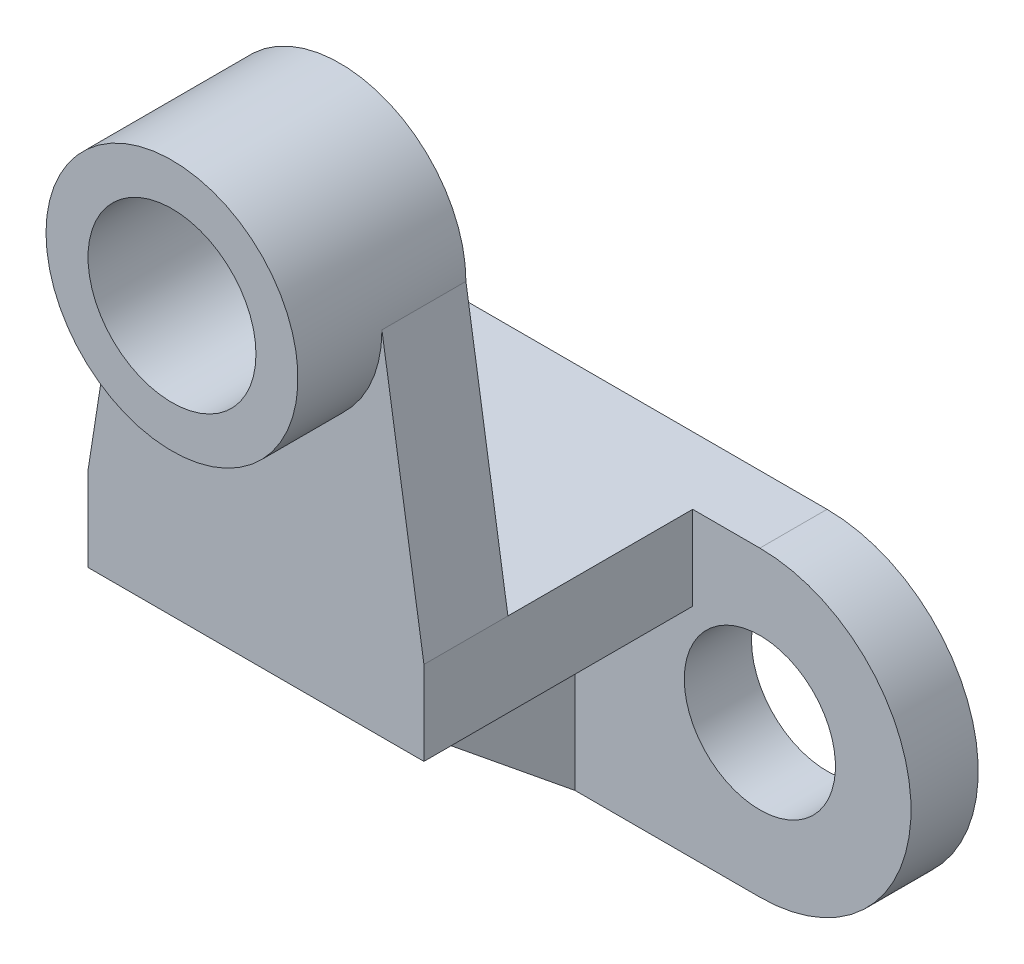
ISO-10303-21;
HEADER;
FILE_DESCRIPTION(('STEP AP214'),'2;1');
FILE_NAME('part.step','',(''),(''),'','','');
FILE_SCHEMA(('AUTOMOTIVE_DESIGN { 1 0 10303 214 1 1 1 1 }'));
ENDSEC;
DATA;
#1=APPLICATION_CONTEXT('core data for automotive mechanical design processes');
#2=APPLICATION_PROTOCOL_DEFINITION('international standard','automotive_design',2000,#1);
#3=PRODUCT_CONTEXT('',#1,'mechanical');
#4=PRODUCT('Part','Part','',(#3));
#5=PRODUCT_RELATED_PRODUCT_CATEGORY('part','',(#4));
#6=PRODUCT_DEFINITION_FORMATION('','',#4);
#7=PRODUCT_DEFINITION_CONTEXT('part definition',#1,'design');
#8=PRODUCT_DEFINITION('design','',#6,#7);
#9=PRODUCT_DEFINITION_SHAPE('','',#8);
#10=(LENGTH_UNIT() NAMED_UNIT(*) SI_UNIT(.MILLI.,.METRE.));
#11=(NAMED_UNIT(*) PLANE_ANGLE_UNIT() SI_UNIT($,.RADIAN.));
#12=(NAMED_UNIT(*) SI_UNIT($,.STERADIAN.) SOLID_ANGLE_UNIT());
#13=UNCERTAINTY_MEASURE_WITH_UNIT(LENGTH_MEASURE(1.E-05),#10,'distance_accuracy_value','');
#14=(GEOMETRIC_REPRESENTATION_CONTEXT(3) GLOBAL_UNCERTAINTY_ASSIGNED_CONTEXT((#13)) GLOBAL_UNIT_ASSIGNED_CONTEXT((#10,
#11,#12)) REPRESENTATION_CONTEXT('',''));
#15=CARTESIAN_POINT('',(0.,0.,0.));
#16=DIRECTION('',(0.,0.,1.));
#17=DIRECTION('',(1.,0.,0.));
#18=AXIS2_PLACEMENT_3D('',#15,#16,#17);
#19=CARTESIAN_POINT('',(56.,36.,8.));
#20=DIRECTION('',(0.,-1.,0.));
#21=DIRECTION('',(0.,0.,-1.));
#22=AXIS2_PLACEMENT_3D('',#19,#20,#21);
#23=PLANE('',#22);
#24=DIRECTION('',(-1.,0.,0.));
#25=VECTOR('',#24,1.);
#26=CARTESIAN_POINT('',(48.,36.,30.));
#27=LINE('',#26,#25);
#28=CARTESIAN_POINT('',(48.,36.,30.));
#29=VERTEX_POINT('',#28);
#30=CARTESIAN_POINT('',(8.,36.,30.));
#31=VERTEX_POINT('',#30);
#32=EDGE_CURVE('E162',#29,#31,#27,.T.);
#33=ORIENTED_EDGE('',*,*,#32,.F.);
#34=DIRECTION('',(0.,0.,-1.));
#35=VECTOR('',#34,1.);
#36=CARTESIAN_POINT('',(48.,36.,40.));
#37=LINE('',#36,#35);
#38=CARTESIAN_POINT('',(48.,36.,8.));
#39=VERTEX_POINT('',#38);
#40=EDGE_CURVE('E174',#29,#39,#37,.T.);
#41=ORIENTED_EDGE('',*,*,#40,.T.);
#42=DIRECTION('',(-1.,0.,0.));
#43=VECTOR('',#42,1.);
#44=CARTESIAN_POINT('',(56.,36.,8.));
#45=LINE('',#44,#43);
#46=CARTESIAN_POINT('',(56.,36.,8.));
#47=VERTEX_POINT('',#46);
#48=EDGE_CURVE('E225',#47,#39,#45,.T.);
#49=ORIENTED_EDGE('',*,*,#48,.F.);
#50=DIRECTION('',(0.,0.,-1.));
#51=VECTOR('',#50,1.);
#52=CARTESIAN_POINT('',(56.,36.,8.));
#53=LINE('',#52,#51);
#54=CARTESIAN_POINT('',(56.,36.,0.));
#55=VERTEX_POINT('',#54);
#56=EDGE_CURVE('E261',#47,#55,#53,.T.);
#57=ORIENTED_EDGE('',*,*,#56,.T.);
#58=DIRECTION('',(-1.,0.,0.));
#59=VECTOR('',#58,1.);
#60=CARTESIAN_POINT('',(56.,36.,0.));
#61=LINE('',#60,#59);
#62=CARTESIAN_POINT('',(0.,36.,0.));
#63=VERTEX_POINT('',#62);
#64=EDGE_CURVE('E242',#55,#63,#61,.T.);
#65=ORIENTED_EDGE('',*,*,#64,.T.);
#66=DIRECTION('',(0.,0.,-1.));
#67=VECTOR('',#66,1.);
#68=CARTESIAN_POINT('',(0.,36.,8.));
#69=LINE('',#68,#67);
#70=CARTESIAN_POINT('',(0.,36.,8.));
#71=VERTEX_POINT('',#70);
#72=EDGE_CURVE('E258',#71,#63,#69,.T.);
#73=ORIENTED_EDGE('',*,*,#72,.F.);
#74=CARTESIAN_POINT('',(8.,36.,8.));
#75=VERTEX_POINT('',#74);
#76=EDGE_CURVE('E172',#75,#71,#45,.T.);
#77=ORIENTED_EDGE('',*,*,#76,.F.);
#78=DIRECTION('',(0.,0.,-1.));
#79=VECTOR('',#78,1.);
#80=CARTESIAN_POINT('',(8.,36.,40.));
#81=LINE('',#80,#79);
#82=EDGE_CURVE('E154',#31,#75,#81,.T.);
#83=ORIENTED_EDGE('',*,*,#82,.F.);
#84=EDGE_LOOP('',(#33,#41,#49,#57,#65,#73,#77,#83));
#85=FACE_BOUND('',#84,.T.);
#86=ADVANCED_FACE('F39',(#85),#23,.F.);
#87=CARTESIAN_POINT('',(56.,18.,8.));
#88=DIRECTION('',(0.,0.,1.));
#89=DIRECTION('',(1.,0.,0.));
#90=AXIS2_PLACEMENT_3D('',#87,#88,#89);
#91=PLANE('',#90);
#92=DIRECTION('',(0.,1.,0.));
#93=VECTOR('',#92,1.);
#94=CARTESIAN_POINT('',(48.,36.,8.));
#95=LINE('',#94,#93);
#96=CARTESIAN_POINT('',(48.,26.,8.));
#97=VERTEX_POINT('',#96);
#98=EDGE_CURVE('E185',#97,#39,#95,.T.);
#99=ORIENTED_EDGE('',*,*,#98,.F.);
#100=DIRECTION('',(1.,0.,0.));
#101=VECTOR('',#100,1.);
#102=CARTESIAN_POINT('',(48.,26.,8.));
#103=LINE('',#102,#101);
#104=CARTESIAN_POINT('',(34.,26.,8.));
#105=VERTEX_POINT('',#104);
#106=EDGE_CURVE('E317',#105,#97,#103,.T.);
#107=ORIENTED_EDGE('',*,*,#106,.F.);
#108=DIRECTION('',(0.,1.,0.));
#109=VECTOR('',#108,1.);
#110=CARTESIAN_POINT('',(34.,26.,8.));
#111=LINE('',#110,#109);
#112=CARTESIAN_POINT('',(34.,0.,8.));
#113=VERTEX_POINT('',#112);
#114=EDGE_CURVE('E314',#113,#105,#111,.T.);
#115=ORIENTED_EDGE('',*,*,#114,.F.);
#116=DIRECTION('',(1.,0.,0.));
#117=VECTOR('',#116,1.);
#118=CARTESIAN_POINT('',(0.,0.,8.));
#119=LINE('',#118,#117);
#120=CARTESIAN_POINT('',(56.,0.,8.));
#121=VERTEX_POINT('',#120);
#122=EDGE_CURVE('E233',#113,#121,#119,.T.);
#123=ORIENTED_EDGE('',*,*,#122,.T.);
#124=CARTESIAN_POINT('',(56.,18.,8.));
#125=DIRECTION('',(0.,0.,1.));
#126=DIRECTION('',(1.,0.,0.));
#127=AXIS2_PLACEMENT_3D('',#124,#125,#126);
#128=CIRCLE('',#127,18.);
#129=EDGE_CURVE('E220',#121,#47,#128,.T.);
#130=ORIENTED_EDGE('',*,*,#129,.T.);
#131=ORIENTED_EDGE('',*,*,#48,.T.);
#132=EDGE_LOOP('',(#99,#107,#115,#123,#130,#131));
#133=FACE_BOUND('',#132,.T.);
#134=CARTESIAN_POINT('',(56.,18.,8.));
#135=DIRECTION('',(0.,0.,-1.));
#136=DIRECTION('',(-1.,0.,0.));
#137=AXIS2_PLACEMENT_3D('',#134,#135,#136);
#138=CIRCLE('',#137,9.);
#139=CARTESIAN_POINT('',(47.,18.,8.));
#140=VERTEX_POINT('',#139);
#141=EDGE_CURVE('E203',#140,#140,#138,.T.);
#142=ORIENTED_EDGE('',*,*,#141,.T.);
#143=EDGE_LOOP('',(#142));
#144=FACE_BOUND('',#143,.T.);
#145=ADVANCED_FACE('F328',(#133,#144),#91,.T.);
#146=CARTESIAN_POINT('',(56.,18.,8.));
#147=DIRECTION('',(0.,0.,-1.));
#148=DIRECTION('',(-1.,0.,0.));
#149=AXIS2_PLACEMENT_3D('',#146,#147,#148);
#150=CYLINDRICAL_SURFACE('',#149,18.);
#151=CARTESIAN_POINT('',(56.,18.,0.));
#152=DIRECTION('',(0.,0.,1.));
#153=DIRECTION('',(1.,0.,0.));
#154=AXIS2_PLACEMENT_3D('',#151,#152,#153);
#155=CIRCLE('',#154,18.);
#156=CARTESIAN_POINT('',(56.,0.,0.));
#157=VERTEX_POINT('',#156);
#158=EDGE_CURVE('E208',#157,#55,#155,.T.);
#159=ORIENTED_EDGE('',*,*,#158,.T.);
#160=ORIENTED_EDGE('',*,*,#56,.F.);
#161=ORIENTED_EDGE('',*,*,#129,.F.);
#162=DIRECTION('',(0.,0.,-1.));
#163=VECTOR('',#162,1.);
#164=CARTESIAN_POINT('',(56.,0.,8.));
#165=LINE('',#164,#163);
#166=EDGE_CURVE('E238',#121,#157,#165,.T.);
#167=ORIENTED_EDGE('',*,*,#166,.T.);
#168=EDGE_LOOP('',(#159,#160,#161,#167));
#169=FACE_BOUND('',#168,.T.);
#170=ADVANCED_FACE('F41',(#169),#150,.T.);
#171=CARTESIAN_POINT('',(0.,18.,8.));
#172=DIRECTION('',(0.,0.,-1.));
#173=DIRECTION('',(-1.,0.,0.));
#174=AXIS2_PLACEMENT_3D('',#171,#172,#173);
#175=CYLINDRICAL_SURFACE('',#174,18.);
#176=CARTESIAN_POINT('',(0.,18.,0.));
#177=DIRECTION('',(0.,0.,-1.));
#178=DIRECTION('',(-1.,0.,0.));
#179=AXIS2_PLACEMENT_3D('',#176,#177,#178);
#180=CIRCLE('',#179,18.);
#181=CARTESIAN_POINT('',(0.,0.,0.));
#182=VERTEX_POINT('',#181);
#183=EDGE_CURVE('E246',#182,#63,#180,.T.);
#184=ORIENTED_EDGE('',*,*,#183,.F.);
#185=DIRECTION('',(0.,0.,-1.));
#186=VECTOR('',#185,1.);
#187=CARTESIAN_POINT('',(0.,0.,8.));
#188=LINE('',#187,#186);
#189=CARTESIAN_POINT('',(0.,0.,8.));
#190=VERTEX_POINT('',#189);
#191=EDGE_CURVE('E255',#190,#182,#188,.T.);
#192=ORIENTED_EDGE('',*,*,#191,.F.);
#193=CARTESIAN_POINT('',(0.,18.,8.));
#194=DIRECTION('',(0.,0.,-1.));
#195=DIRECTION('',(-1.,0.,0.));
#196=AXIS2_PLACEMENT_3D('',#193,#194,#195);
#197=CIRCLE('',#196,18.);
#198=EDGE_CURVE('E229',#190,#71,#197,.T.);
#199=ORIENTED_EDGE('',*,*,#198,.T.);
#200=ORIENTED_EDGE('',*,*,#72,.T.);
#201=EDGE_LOOP('',(#184,#192,#199,#200));
#202=FACE_BOUND('',#201,.T.);
#203=ADVANCED_FACE('F341',(#202),#175,.T.);
#204=CARTESIAN_POINT('',(0.,0.,8.));
#205=DIRECTION('',(0.,1.,0.));
#206=DIRECTION('',(0.,0.,1.));
#207=AXIS2_PLACEMENT_3D('',#204,#205,#206);
#208=PLANE('',#207);
#209=ORIENTED_EDGE('',*,*,#122,.F.);
#210=DIRECTION('',(1.,0.,0.));
#211=VECTOR('',#210,1.);
#212=CARTESIAN_POINT('',(22.,0.,8.));
#213=LINE('',#212,#211);
#214=CARTESIAN_POINT('',(22.,0.,8.));
#215=VERTEX_POINT('',#214);
#216=EDGE_CURVE('E286',#215,#113,#213,.T.);
#217=ORIENTED_EDGE('',*,*,#216,.F.);
#218=EDGE_CURVE('E234',#190,#215,#119,.T.);
#219=ORIENTED_EDGE('',*,*,#218,.F.);
#220=ORIENTED_EDGE('',*,*,#191,.T.);
#221=DIRECTION('',(1.,0.,0.));
#222=VECTOR('',#221,1.);
#223=CARTESIAN_POINT('',(0.,0.,0.));
#224=LINE('',#223,#222);
#225=EDGE_CURVE('E224',#182,#157,#224,.T.);
#226=ORIENTED_EDGE('',*,*,#225,.T.);
#227=ORIENTED_EDGE('',*,*,#166,.F.);
#228=EDGE_LOOP('',(#209,#217,#219,#220,#226,#227));
#229=FACE_BOUND('',#228,.T.);
#230=ADVANCED_FACE('F352',(#229),#208,.F.);
#231=DIRECTION('',(0.,-1.,0.));
#232=VECTOR('',#231,1.);
#233=CARTESIAN_POINT('',(8.,26.,8.));
#234=LINE('',#233,#232);
#235=CARTESIAN_POINT('',(8.,26.,8.));
#236=VERTEX_POINT('',#235);
#237=EDGE_CURVE('E293',#75,#236,#234,.T.);
#238=ORIENTED_EDGE('',*,*,#237,.F.);
#239=ORIENTED_EDGE('',*,*,#76,.T.);
#240=ORIENTED_EDGE('',*,*,#198,.F.);
#241=ORIENTED_EDGE('',*,*,#218,.T.);
#242=DIRECTION('',(0.,-1.,0.));
#243=VECTOR('',#242,1.);
#244=CARTESIAN_POINT('',(22.,0.,8.));
#245=LINE('',#244,#243);
#246=CARTESIAN_POINT('',(22.,26.,8.));
#247=VERTEX_POINT('',#246);
#248=EDGE_CURVE('E310',#247,#215,#245,.T.);
#249=ORIENTED_EDGE('',*,*,#248,.F.);
#250=DIRECTION('',(1.,0.,0.));
#251=VECTOR('',#250,1.);
#252=CARTESIAN_POINT('',(22.,26.,8.));
#253=LINE('',#252,#251);
#254=EDGE_CURVE('E306',#236,#247,#253,.T.);
#255=ORIENTED_EDGE('',*,*,#254,.F.);
#256=EDGE_LOOP('',(#238,#239,#240,#241,#249,#255));
#257=FACE_BOUND('',#256,.T.);
#258=CARTESIAN_POINT('',(0.,18.,8.));
#259=DIRECTION('',(0.,0.,-1.));
#260=DIRECTION('',(-1.,0.,0.));
#261=AXIS2_PLACEMENT_3D('',#258,#259,#260);
#262=CIRCLE('',#261,9.);
#263=CARTESIAN_POINT('',(-9.,18.,8.));
#264=VERTEX_POINT('',#263);
#265=EDGE_CURVE('E204',#264,#264,#262,.T.);
#266=ORIENTED_EDGE('',*,*,#265,.T.);
#267=EDGE_LOOP('',(#266));
#268=FACE_BOUND('',#267,.T.);
#269=ADVANCED_FACE('F345',(#257,#268),#91,.T.);
#270=CARTESIAN_POINT('',(56.,18.,0.));
#271=DIRECTION('',(0.,0.,1.));
#272=DIRECTION('',(1.,0.,0.));
#273=AXIS2_PLACEMENT_3D('',#270,#271,#272);
#274=PLANE('',#273);
#275=CARTESIAN_POINT('',(0.,18.,0.));
#276=DIRECTION('',(0.,0.,-1.));
#277=DIRECTION('',(-1.,0.,0.));
#278=AXIS2_PLACEMENT_3D('',#275,#276,#277);
#279=CIRCLE('',#278,9.);
#280=CARTESIAN_POINT('',(-9.,18.,0.));
#281=VERTEX_POINT('',#280);
#282=EDGE_CURVE('E209',#281,#281,#279,.T.);
#283=ORIENTED_EDGE('',*,*,#282,.F.);
#284=EDGE_LOOP('',(#283));
#285=FACE_BOUND('',#284,.T.);
#286=CARTESIAN_POINT('',(56.,18.,0.));
#287=DIRECTION('',(0.,0.,-1.));
#288=DIRECTION('',(-1.,0.,0.));
#289=AXIS2_PLACEMENT_3D('',#286,#287,#288);
#290=CIRCLE('',#289,9.);
#291=CARTESIAN_POINT('',(47.,18.,0.));
#292=VERTEX_POINT('',#291);
#293=EDGE_CURVE('E213',#292,#292,#290,.T.);
#294=ORIENTED_EDGE('',*,*,#293,.F.);
#295=EDGE_LOOP('',(#294));
#296=FACE_BOUND('',#295,.T.);
#297=ORIENTED_EDGE('',*,*,#158,.F.);
#298=ORIENTED_EDGE('',*,*,#225,.F.);
#299=ORIENTED_EDGE('',*,*,#183,.T.);
#300=ORIENTED_EDGE('',*,*,#64,.F.);
#301=EDGE_LOOP('',(#297,#298,#299,#300));
#302=FACE_BOUND('',#301,.T.);
#303=ADVANCED_FACE('F338',(#285,#296,#302),#274,.F.);
#304=CARTESIAN_POINT('',(56.,18.,8.));
#305=DIRECTION('',(0.,0.,-1.));
#306=DIRECTION('',(-1.,0.,0.));
#307=AXIS2_PLACEMENT_3D('',#304,#305,#306);
#308=CYLINDRICAL_SURFACE('',#307,9.);
#309=ORIENTED_EDGE('',*,*,#141,.F.);
#310=EDGE_LOOP('',(#309));
#311=FACE_BOUND('',#310,.T.);
#312=ORIENTED_EDGE('',*,*,#293,.T.);
#313=EDGE_LOOP('',(#312));
#314=FACE_BOUND('',#313,.T.);
#315=ADVANCED_FACE('F390',(#311,#314),#308,.F.);
#316=CARTESIAN_POINT('',(0.,18.,8.));
#317=DIRECTION('',(0.,0.,-1.));
#318=DIRECTION('',(-1.,0.,0.));
#319=AXIS2_PLACEMENT_3D('',#316,#317,#318);
#320=CYLINDRICAL_SURFACE('',#319,9.);
#321=ORIENTED_EDGE('',*,*,#265,.F.);
#322=EDGE_LOOP('',(#321));
#323=FACE_BOUND('',#322,.T.);
#324=ORIENTED_EDGE('',*,*,#282,.T.);
#325=EDGE_LOOP('',(#324));
#326=FACE_BOUND('',#325,.T.);
#327=ADVANCED_FACE('F377',(#323,#326),#320,.F.);
#328=CARTESIAN_POINT('',(8.,26.,40.));
#329=DIRECTION('',(1.,0.,0.));
#330=DIRECTION('',(0.,0.,-1.));
#331=AXIS2_PLACEMENT_3D('',#328,#329,#330);
#332=PLANE('',#331);
#333=DIRECTION('',(0.,-1.,0.));
#334=VECTOR('',#333,1.);
#335=CARTESIAN_POINT('',(8.,26.,40.));
#336=LINE('',#335,#334);
#337=CARTESIAN_POINT('',(8.,36.,40.));
#338=VERTEX_POINT('',#337);
#339=CARTESIAN_POINT('',(8.,26.,40.));
#340=VERTEX_POINT('',#339);
#341=EDGE_CURVE('E157',#338,#340,#336,.T.);
#342=ORIENTED_EDGE('',*,*,#341,.F.);
#343=DIRECTION('',(0.,0.,1.));
#344=VECTOR('',#343,1.);
#345=CARTESIAN_POINT('',(8.,36.,30.));
#346=LINE('',#345,#344);
#347=EDGE_CURVE('E141',#31,#338,#346,.T.);
#348=ORIENTED_EDGE('',*,*,#347,.F.);
#349=ORIENTED_EDGE('',*,*,#82,.T.);
#350=ORIENTED_EDGE('',*,*,#237,.T.);
#351=DIRECTION('',(0.,0.,-1.));
#352=VECTOR('',#351,1.);
#353=CARTESIAN_POINT('',(8.,26.,40.));
#354=LINE('',#353,#352);
#355=EDGE_CURVE('E199',#340,#236,#354,.T.);
#356=ORIENTED_EDGE('',*,*,#355,.F.);
#357=EDGE_LOOP('',(#342,#348,#349,#350,#356));
#358=FACE_BOUND('',#357,.T.);
#359=ADVANCED_FACE('F151',(#358),#332,.F.);
#360=CARTESIAN_POINT('',(22.,26.,40.));
#361=DIRECTION('',(0.,1.,0.));
#362=DIRECTION('',(-1.,0.,0.));
#363=AXIS2_PLACEMENT_3D('',#360,#361,#362);
#364=PLANE('',#363);
#365=ORIENTED_EDGE('',*,*,#254,.T.);
#366=DIRECTION('',(0.,0.,-1.));
#367=VECTOR('',#366,1.);
#368=CARTESIAN_POINT('',(22.,26.,40.));
#369=LINE('',#368,#367);
#370=CARTESIAN_POINT('',(22.,26.,40.));
#371=VERTEX_POINT('',#370);
#372=EDGE_CURVE('E195',#371,#247,#369,.T.);
#373=ORIENTED_EDGE('',*,*,#372,.F.);
#374=DIRECTION('',(1.,0.,0.));
#375=VECTOR('',#374,1.);
#376=CARTESIAN_POINT('',(22.,26.,40.));
#377=LINE('',#376,#375);
#378=EDGE_CURVE('E298',#340,#371,#377,.T.);
#379=ORIENTED_EDGE('',*,*,#378,.F.);
#380=ORIENTED_EDGE('',*,*,#355,.T.);
#381=EDGE_LOOP('',(#365,#373,#379,#380));
#382=FACE_BOUND('',#381,.T.);
#383=ADVANCED_FACE('F369',(#382),#364,.F.);
#384=CARTESIAN_POINT('',(22.,0.,40.));
#385=DIRECTION('',(1.,0.,0.));
#386=DIRECTION('',(0.,0.,-1.));
#387=AXIS2_PLACEMENT_3D('',#384,#385,#386);
#388=PLANE('',#387);
#389=ORIENTED_EDGE('',*,*,#248,.T.);
#390=DIRECTION('',(0.,0.630592625094466,0.776114000116266));
#391=VECTOR('',#390,1.);
#392=CARTESIAN_POINT('',(22.,26.,40.));
#393=LINE('',#392,#391);
#394=EDGE_CURVE('E282',#215,#371,#393,.T.);
#395=ORIENTED_EDGE('',*,*,#394,.T.);
#396=ORIENTED_EDGE('',*,*,#372,.T.);
#397=EDGE_LOOP('',(#389,#395,#396));
#398=FACE_BOUND('',#397,.T.);
#399=ADVANCED_FACE('F367',(#398),#388,.F.);
#400=CARTESIAN_POINT('',(34.,26.,40.));
#401=DIRECTION('',(-1.,0.,0.));
#402=DIRECTION('',(0.,0.,1.));
#403=AXIS2_PLACEMENT_3D('',#400,#401,#402);
#404=PLANE('',#403);
#405=DIRECTION('',(0.,0.,-1.));
#406=VECTOR('',#405,1.);
#407=CARTESIAN_POINT('',(34.,26.,40.));
#408=LINE('',#407,#406);
#409=CARTESIAN_POINT('',(34.,26.,40.));
#410=VERTEX_POINT('',#409);
#411=EDGE_CURVE('E191',#410,#105,#408,.T.);
#412=ORIENTED_EDGE('',*,*,#411,.F.);
#413=DIRECTION('',(0.,0.630592625094466,0.776114000116266));
#414=VECTOR('',#413,1.);
#415=CARTESIAN_POINT('',(34.,26.,40.));
#416=LINE('',#415,#414);
#417=EDGE_CURVE('E167',#113,#410,#416,.T.);
#418=ORIENTED_EDGE('',*,*,#417,.F.);
#419=ORIENTED_EDGE('',*,*,#114,.T.);
#420=EDGE_LOOP('',(#412,#418,#419));
#421=FACE_BOUND('',#420,.T.);
#422=ADVANCED_FACE('F358',(#421),#404,.F.);
#423=CARTESIAN_POINT('',(48.,26.,40.));
#424=DIRECTION('',(0.,1.,0.));
#425=DIRECTION('',(0.,0.,1.));
#426=AXIS2_PLACEMENT_3D('',#423,#424,#425);
#427=PLANE('',#426);
#428=ORIENTED_EDGE('',*,*,#106,.T.);
#429=DIRECTION('',(0.,0.,-1.));
#430=VECTOR('',#429,1.);
#431=CARTESIAN_POINT('',(48.,26.,40.));
#432=LINE('',#431,#430);
#433=CARTESIAN_POINT('',(48.,26.,40.));
#434=VERTEX_POINT('',#433);
#435=EDGE_CURVE('E179',#434,#97,#432,.T.);
#436=ORIENTED_EDGE('',*,*,#435,.F.);
#437=DIRECTION('',(1.,0.,0.));
#438=VECTOR('',#437,1.);
#439=CARTESIAN_POINT('',(48.,26.,40.));
#440=LINE('',#439,#438);
#441=EDGE_CURVE('E182',#410,#434,#440,.T.);
#442=ORIENTED_EDGE('',*,*,#441,.F.);
#443=ORIENTED_EDGE('',*,*,#411,.T.);
#444=EDGE_LOOP('',(#428,#436,#442,#443));
#445=FACE_BOUND('',#444,.T.);
#446=ADVANCED_FACE('F360',(#445),#427,.F.);
#447=CARTESIAN_POINT('',(48.,36.,40.));
#448=DIRECTION('',(-1.,0.,0.));
#449=DIRECTION('',(0.,0.,1.));
#450=AXIS2_PLACEMENT_3D('',#447,#448,#449);
#451=PLANE('',#450);
#452=ORIENTED_EDGE('',*,*,#40,.F.);
#453=DIRECTION('',(0.,0.,1.));
#454=VECTOR('',#453,1.);
#455=CARTESIAN_POINT('',(48.,36.,30.));
#456=LINE('',#455,#454);
#457=CARTESIAN_POINT('',(48.,36.,40.));
#458=VERTEX_POINT('',#457);
#459=EDGE_CURVE('E271',#29,#458,#456,.T.);
#460=ORIENTED_EDGE('',*,*,#459,.T.);
#461=DIRECTION('',(0.,1.,0.));
#462=VECTOR('',#461,1.);
#463=CARTESIAN_POINT('',(48.,36.,40.));
#464=LINE('',#463,#462);
#465=EDGE_CURVE('E175',#434,#458,#464,.T.);
#466=ORIENTED_EDGE('',*,*,#465,.F.);
#467=ORIENTED_EDGE('',*,*,#435,.T.);
#468=ORIENTED_EDGE('',*,*,#98,.T.);
#469=EDGE_LOOP('',(#452,#460,#466,#467,#468));
#470=FACE_BOUND('',#469,.T.);
#471=ADVANCED_FACE('F325',(#470),#451,.F.);
#472=CARTESIAN_POINT('',(0.,0.,40.));
#473=DIRECTION('',(0.,0.,-1.));
#474=DIRECTION('',(-1.,0.,0.));
#475=AXIS2_PLACEMENT_3D('',#472,#473,#474);
#476=PLANE('',#475);
#477=CARTESIAN_POINT('',(28.,68.,40.));
#478=DIRECTION('',(0.,0.,-1.));
#479=DIRECTION('',(-1.,0.,0.));
#480=AXIS2_PLACEMENT_3D('',#477,#478,#479);
#481=CIRCLE('',#480,15.);
#482=CARTESIAN_POINT('',(43.,68.,40.));
#483=VERTEX_POINT('',#482);
#484=CARTESIAN_POINT('',(13.,68.,40.));
#485=VERTEX_POINT('',#484);
#486=EDGE_CURVE('E168',#483,#485,#481,.T.);
#487=ORIENTED_EDGE('',*,*,#486,.T.);
#488=DIRECTION('',(0.15437688027361,0.988012033751101,0.));
#489=VECTOR('',#488,1.);
#490=CARTESIAN_POINT('',(13.,67.9999999999999,40.));
#491=LINE('',#490,#489);
#492=EDGE_CURVE('E62',#338,#485,#491,.T.);
#493=ORIENTED_EDGE('',*,*,#492,.F.);
#494=ORIENTED_EDGE('',*,*,#341,.T.);
#495=ORIENTED_EDGE('',*,*,#378,.T.);
#496=DIRECTION('',(1.,0.,0.));
#497=VECTOR('',#496,1.);
#498=CARTESIAN_POINT('',(22.,26.,40.));
#499=LINE('',#498,#497);
#500=EDGE_CURVE('E289',#371,#410,#499,.T.);
#501=ORIENTED_EDGE('',*,*,#500,.T.);
#502=ORIENTED_EDGE('',*,*,#441,.T.);
#503=ORIENTED_EDGE('',*,*,#465,.T.);
#504=DIRECTION('',(0.15437688027361,-0.988012033751101,0.));
#505=VECTOR('',#504,1.);
#506=CARTESIAN_POINT('',(43.,68.,40.));
#507=LINE('',#506,#505);
#508=EDGE_CURVE('E159',#483,#458,#507,.T.);
#509=ORIENTED_EDGE('',*,*,#508,.F.);
#510=EDGE_LOOP('',(#487,#493,#494,#495,#501,#502,#503,#509));
#511=FACE_BOUND('',#510,.T.);
#512=ADVANCED_FACE('F362',(#511),#476,.F.);
#513=CARTESIAN_POINT('',(22.,26.,40.));
#514=DIRECTION('',(0.,0.776114000116266,-0.630592625094466));
#515=DIRECTION('',(0.,0.630592625094466,0.776114000116266));
#516=AXIS2_PLACEMENT_3D('',#513,#514,#515);
#517=PLANE('',#516);
#518=ORIENTED_EDGE('',*,*,#417,.T.);
#519=ORIENTED_EDGE('',*,*,#500,.F.);
#520=ORIENTED_EDGE('',*,*,#394,.F.);
#521=ORIENTED_EDGE('',*,*,#216,.T.);
#522=EDGE_LOOP('',(#518,#519,#520,#521));
#523=FACE_BOUND('',#522,.T.);
#524=ADVANCED_FACE('F355',(#523),#517,.F.);
#525=CARTESIAN_POINT('',(48.,68.,30.));
#526=DIRECTION('',(0.,0.,1.));
#527=DIRECTION('',(1.,0.,0.));
#528=AXIS2_PLACEMENT_3D('',#525,#526,#527);
#529=PLANE('',#528);
#530=CARTESIAN_POINT('',(28.,68.,30.));
#531=DIRECTION('',(0.,0.,1.));
#532=DIRECTION('',(1.,0.,0.));
#533=AXIS2_PLACEMENT_3D('',#530,#531,#532);
#534=CIRCLE('',#533,10.);
#535=CARTESIAN_POINT('',(38.,68.,30.));
#536=VERTEX_POINT('',#535);
#537=EDGE_CURVE('E593',#536,#536,#534,.T.);
#538=ORIENTED_EDGE('',*,*,#537,.T.);
#539=EDGE_LOOP('',(#538));
#540=FACE_BOUND('',#539,.T.);
#541=ORIENTED_EDGE('',*,*,#32,.T.);
#542=DIRECTION('',(0.15437688027361,0.988012033751101,0.));
#543=VECTOR('',#542,1.);
#544=CARTESIAN_POINT('',(13.,67.9999999999999,30.));
#545=LINE('',#544,#543);
#546=CARTESIAN_POINT('',(13.,67.9999999999999,30.));
#547=VERTEX_POINT('',#546);
#548=EDGE_CURVE('E138',#31,#547,#545,.T.);
#549=ORIENTED_EDGE('',*,*,#548,.T.);
#550=CARTESIAN_POINT('',(28.,68.,30.));
#551=DIRECTION('',(0.,0.,-1.));
#552=DIRECTION('',(-1.,0.,0.));
#553=AXIS2_PLACEMENT_3D('',#550,#551,#552);
#554=CIRCLE('',#553,15.);
#555=CARTESIAN_POINT('',(43.,68.,30.));
#556=VERTEX_POINT('',#555);
#557=EDGE_CURVE('E268',#547,#556,#554,.T.);
#558=ORIENTED_EDGE('',*,*,#557,.T.);
#559=DIRECTION('',(0.15437688027361,-0.988012033751101,0.));
#560=VECTOR('',#559,1.);
#561=CARTESIAN_POINT('',(43.,68.,30.));
#562=LINE('',#561,#560);
#563=EDGE_CURVE('E55',#556,#29,#562,.T.);
#564=ORIENTED_EDGE('',*,*,#563,.T.);
#565=EDGE_LOOP('',(#541,#549,#558,#564));
#566=FACE_BOUND('',#565,.T.);
#567=ADVANCED_FACE('F163',(#540,#566),#529,.F.);
#568=CARTESIAN_POINT('',(28.,68.,50.));
#569=DIRECTION('',(0.,0.,-1.));
#570=DIRECTION('',(-1.,0.,0.));
#571=AXIS2_PLACEMENT_3D('',#568,#569,#570);
#572=CYLINDRICAL_SURFACE('',#571,15.);
#573=CARTESIAN_POINT('',(28.,68.,50.));
#574=DIRECTION('',(0.,0.,-1.));
#575=DIRECTION('',(-1.,0.,0.));
#576=AXIS2_PLACEMENT_3D('',#573,#574,#575);
#577=CIRCLE('',#576,15.);
#578=CARTESIAN_POINT('',(13.,68.,50.));
#579=VERTEX_POINT('',#578);
#580=EDGE_CURVE('E270',#579,#579,#577,.T.);
#581=ORIENTED_EDGE('',*,*,#580,.T.);
#582=EDGE_LOOP('',(#581));
#583=FACE_BOUND('',#582,.T.);
#584=ORIENTED_EDGE('',*,*,#486,.F.);
#585=DIRECTION('',(0.,0.,-1.));
#586=VECTOR('',#585,1.);
#587=CARTESIAN_POINT('',(43.,68.,50.));
#588=LINE('',#587,#586);
#589=EDGE_CURVE('E11',#483,#556,#588,.T.);
#590=ORIENTED_EDGE('',*,*,#589,.T.);
#591=ORIENTED_EDGE('',*,*,#557,.F.);
#592=DIRECTION('',(0.,0.,-1.));
#593=VECTOR('',#592,1.);
#594=CARTESIAN_POINT('',(13.,68.,50.));
#595=LINE('',#594,#593);
#596=EDGE_CURVE('E48',#547,#485,#595,.F.);
#597=ORIENTED_EDGE('',*,*,#596,.T.);
#598=EDGE_LOOP('',(#584,#590,#591,#597));
#599=FACE_BOUND('',#598,.T.);
#600=ADVANCED_FACE('F267',(#583,#599),#572,.T.);
#601=CARTESIAN_POINT('',(28.,68.,50.));
#602=DIRECTION('',(0.,0.,-1.));
#603=DIRECTION('',(-1.,0.,0.));
#604=AXIS2_PLACEMENT_3D('',#601,#602,#603);
#605=PLANE('',#604);
#606=CARTESIAN_POINT('',(28.,68.,50.));
#607=DIRECTION('',(0.,0.,1.));
#608=DIRECTION('',(1.,0.,0.));
#609=AXIS2_PLACEMENT_3D('',#606,#607,#608);
#610=CIRCLE('',#609,10.);
#611=CARTESIAN_POINT('',(38.,68.,50.));
#612=VERTEX_POINT('',#611);
#613=EDGE_CURVE('E595',#612,#612,#610,.T.);
#614=ORIENTED_EDGE('',*,*,#613,.F.);
#615=EDGE_LOOP('',(#614));
#616=FACE_BOUND('',#615,.T.);
#617=ORIENTED_EDGE('',*,*,#580,.F.);
#618=EDGE_LOOP('',(#617));
#619=FACE_BOUND('',#618,.T.);
#620=ADVANCED_FACE('F440',(#616,#619),#605,.F.);
#621=CARTESIAN_POINT('',(43.,68.,30.));
#622=DIRECTION('',(-0.988012033751101,-0.15437688027361,0.));
#623=DIRECTION('',(0.15437688027361,-0.988012033751101,0.));
#624=AXIS2_PLACEMENT_3D('',#621,#622,#623);
#625=PLANE('',#624);
#626=ORIENTED_EDGE('',*,*,#508,.T.);
#627=ORIENTED_EDGE('',*,*,#459,.F.);
#628=ORIENTED_EDGE('',*,*,#563,.F.);
#629=ORIENTED_EDGE('',*,*,#589,.F.);
#630=EDGE_LOOP('',(#626,#627,#628,#629));
#631=FACE_BOUND('',#630,.T.);
#632=ADVANCED_FACE('F455',(#631),#625,.F.);
#633=CARTESIAN_POINT('',(13.,67.9999999999999,30.));
#634=DIRECTION('',(0.988012033751101,-0.15437688027361,0.));
#635=DIRECTION('',(0.15437688027361,0.988012033751101,0.));
#636=AXIS2_PLACEMENT_3D('',#633,#634,#635);
#637=PLANE('',#636);
#638=ORIENTED_EDGE('',*,*,#492,.T.);
#639=ORIENTED_EDGE('',*,*,#596,.F.);
#640=ORIENTED_EDGE('',*,*,#548,.F.);
#641=ORIENTED_EDGE('',*,*,#347,.T.);
#642=EDGE_LOOP('',(#638,#639,#640,#641));
#643=FACE_BOUND('',#642,.T.);
#644=ADVANCED_FACE('F140',(#643),#637,.F.);
#645=CARTESIAN_POINT('',(28.,68.,30.));
#646=DIRECTION('',(0.,0.,1.));
#647=DIRECTION('',(1.,0.,0.));
#648=AXIS2_PLACEMENT_3D('',#645,#646,#647);
#649=CYLINDRICAL_SURFACE('',#648,10.);
#650=ORIENTED_EDGE('',*,*,#537,.F.);
#651=EDGE_LOOP('',(#650));
#652=FACE_BOUND('',#651,.T.);
#653=ORIENTED_EDGE('',*,*,#613,.T.);
#654=EDGE_LOOP('',(#653));
#655=FACE_BOUND('',#654,.T.);
#656=ADVANCED_FACE('F454',(#652,#655),#649,.F.);
#657=CLOSED_SHELL('',(#86,#145,#170,#203,#230,#269,#303,#315,#327,#359,#383,#399,#422,#446,#471,
#512,#524,#567,#600,#620,#632,#644,#656));
#658=MANIFOLD_SOLID_BREP('B2',#657);
#659=ADVANCED_BREP_SHAPE_REPRESENTATION('',(#18,#658),#14);
#660=SHAPE_DEFINITION_REPRESENTATION(#9,#659);
ENDSEC;
END-ISO-10303-21;
